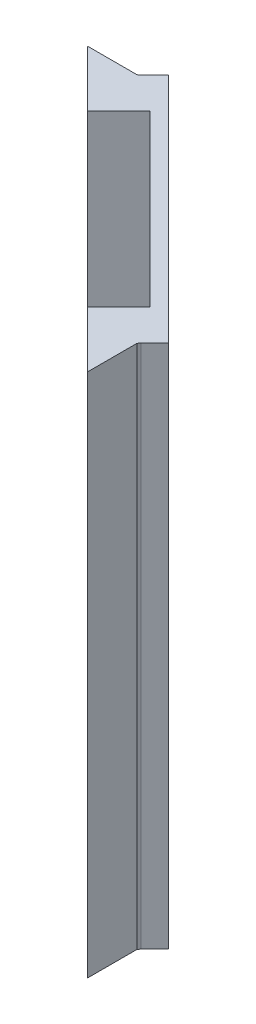
ISO-10303-21;
HEADER;
FILE_DESCRIPTION(('STEP AP214'),'2;1');
FILE_NAME('part.step','',(''),(''),'','','');
FILE_SCHEMA(('AUTOMOTIVE_DESIGN { 1 0 10303 214 1 1 1 1 }'));
ENDSEC;
DATA;
#1=APPLICATION_CONTEXT('core data for automotive mechanical design processes');
#2=APPLICATION_PROTOCOL_DEFINITION('international standard','automotive_design',2000,#1);
#3=PRODUCT_CONTEXT('',#1,'mechanical');
#4=PRODUCT('Part','Part','',(#3));
#5=PRODUCT_RELATED_PRODUCT_CATEGORY('part','',(#4));
#6=PRODUCT_DEFINITION_FORMATION('','',#4);
#7=PRODUCT_DEFINITION_CONTEXT('part definition',#1,'design');
#8=PRODUCT_DEFINITION('design','',#6,#7);
#9=PRODUCT_DEFINITION_SHAPE('','',#8);
#10=(LENGTH_UNIT() NAMED_UNIT(*) SI_UNIT(.MILLI.,.METRE.));
#11=(NAMED_UNIT(*) PLANE_ANGLE_UNIT() SI_UNIT($,.RADIAN.));
#12=(NAMED_UNIT(*) SI_UNIT($,.STERADIAN.) SOLID_ANGLE_UNIT());
#13=UNCERTAINTY_MEASURE_WITH_UNIT(LENGTH_MEASURE(1.E-05),#10,'distance_accuracy_value','');
#14=(GEOMETRIC_REPRESENTATION_CONTEXT(3) GLOBAL_UNCERTAINTY_ASSIGNED_CONTEXT((#13)) GLOBAL_UNIT_ASSIGNED_CONTEXT((#10,
#11,#12)) REPRESENTATION_CONTEXT('',''));
#15=CARTESIAN_POINT('',(0.,0.,0.));
#16=DIRECTION('',(0.,0.,1.));
#17=DIRECTION('',(1.,0.,0.));
#18=AXIS2_PLACEMENT_3D('',#15,#16,#17);
#19=CARTESIAN_POINT('',(45.4413004486133,0.,-45.4413004486145));
#20=DIRECTION('',(0.707106781186538,0.,-0.707106781186557));
#21=DIRECTION('',(-0.707106781186557,0.,-0.707106781186538));
#22=AXIS2_PLACEMENT_3D('',#19,#20,#21);
#23=PLANE('',#22);
#24=DIRECTION('',(0.,-1.,0.));
#25=VECTOR('',#24,1.);
#26=CARTESIAN_POINT('',(80.9542934635455,4.,-9.92830743368317));
#27=LINE('',#26,#25);
#28=CARTESIAN_POINT('',(80.9542934635455,76.,-9.92830743368317));
#29=VERTEX_POINT('',#28);
#30=CARTESIAN_POINT('',(80.9542934635455,4.,-9.92830743368317));
#31=VERTEX_POINT('',#30);
#32=EDGE_CURVE('E220',#29,#31,#27,.T.);
#33=ORIENTED_EDGE('',*,*,#32,.T.);
#34=DIRECTION('',(-0.707106781186557,0.,-0.707106781186538));
#35=VECTOR('',#34,1.);
#36=CARTESIAN_POINT('',(63.2766239338816,4.,-27.6059769633466));
#37=LINE('',#36,#35);
#38=CARTESIAN_POINT('',(63.2766239338816,4.,-27.6059769633466));
#39=VERTEX_POINT('',#38);
#40=EDGE_CURVE('E207',#31,#39,#37,.T.);
#41=ORIENTED_EDGE('',*,*,#40,.T.);
#42=DIRECTION('',(0.,1.,0.));
#43=VECTOR('',#42,1.);
#44=CARTESIAN_POINT('',(63.2766239338816,76.,-27.6059769633466));
#45=LINE('',#44,#43);
#46=CARTESIAN_POINT('',(63.2766239338816,76.,-27.6059769633466));
#47=VERTEX_POINT('',#46);
#48=EDGE_CURVE('E211',#39,#47,#45,.T.);
#49=ORIENTED_EDGE('',*,*,#48,.T.);
#50=DIRECTION('',(0.707106781186556,0.,0.707106781186539));
#51=VECTOR('',#50,1.);
#52=CARTESIAN_POINT('',(80.9542934635455,76.,-9.92830743368317));
#53=LINE('',#52,#51);
#54=EDGE_CURVE('E216',#47,#29,#53,.T.);
#55=ORIENTED_EDGE('',*,*,#54,.T.);
#56=EDGE_LOOP('',(#33,#41,#49,#55));
#57=FACE_BOUND('',#56,.T.);
#58=DIRECTION('',(0.,-1.,0.));
#59=VECTOR('',#58,1.);
#60=CARTESIAN_POINT('',(85.0201574553682,0.,-5.86244344186058));
#61=LINE('',#60,#59);
#62=CARTESIAN_POINT('',(85.0201574553682,80.,-5.86244344186059));
#63=VERTEX_POINT('',#62);
#64=CARTESIAN_POINT('',(85.0201574553682,0.,-5.86244344186058));
#65=VERTEX_POINT('',#64);
#66=EDGE_CURVE('E11',#63,#65,#61,.T.);
#67=ORIENTED_EDGE('',*,*,#66,.F.);
#68=DIRECTION('',(0.707106781186557,0.,0.707106781186538));
#69=VECTOR('',#68,1.);
#70=CARTESIAN_POINT('',(54.4377891690497,80.,-36.4448117281784));
#71=LINE('',#70,#69);
#72=CARTESIAN_POINT('',(59.2107599420589,80.,-31.6718409551692));
#73=VERTEX_POINT('',#72);
#74=EDGE_CURVE('E168',#73,#63,#71,.T.);
#75=ORIENTED_EDGE('',*,*,#74,.F.);
#76=DIRECTION('',(0.,-1.,0.));
#77=VECTOR('',#76,1.);
#78=CARTESIAN_POINT('',(59.2107599420589,80.,-31.6718409551692));
#79=LINE('',#78,#77);
#80=CARTESIAN_POINT('',(59.2107599420589,0.,-31.6718409551692));
#81=VERTEX_POINT('',#80);
#82=EDGE_CURVE('E48',#73,#81,#79,.T.);
#83=ORIENTED_EDGE('',*,*,#82,.T.);
#84=DIRECTION('',(-0.707106781186557,0.,-0.707106781186538));
#85=VECTOR('',#84,1.);
#86=CARTESIAN_POINT('',(89.7931282283775,0.,-1.08947266885144));
#87=LINE('',#86,#85);
#88=EDGE_CURVE('E253',#65,#81,#87,.T.);
#89=ORIENTED_EDGE('',*,*,#88,.F.);
#90=EDGE_LOOP('',(#67,#75,#83,#89));
#91=FACE_BOUND('',#90,.T.);
#92=ADVANCED_FACE('F39',(#57,#91),#23,.F.);
#93=CARTESIAN_POINT('',(54.2610124737531,80.,-26.7220934868633));
#94=DIRECTION('',(-0.707106781186556,0.,-0.707106781186539));
#95=DIRECTION('',(-0.707106781186539,0.,0.707106781186556));
#96=AXIS2_PLACEMENT_3D('',#93,#94,#95);
#97=PLANE('',#96);
#98=ORIENTED_EDGE('',*,*,#82,.F.);
#99=DIRECTION('',(0.707106781186539,0.,-0.707106781186556));
#100=VECTOR('',#99,1.);
#101=CARTESIAN_POINT('',(54.2610124737531,80.,-26.7220934868633));
#102=LINE('',#101,#100);
#103=CARTESIAN_POINT('',(54.4208390212029,80.,-26.8819200343131));
#104=VERTEX_POINT('',#103);
#105=EDGE_CURVE('E313',#104,#73,#102,.T.);
#106=ORIENTED_EDGE('',*,*,#105,.F.);
#107=DIRECTION('',(0.,1.,0.));
#108=VECTOR('',#107,1.);
#109=CARTESIAN_POINT('',(54.4208390212029,80.,-26.8819200343131));
#110=LINE('',#109,#108);
#111=CARTESIAN_POINT('',(54.4208390212029,0.,-26.8819200343131));
#112=VERTEX_POINT('',#111);
#113=EDGE_CURVE('E283',#112,#104,#110,.T.);
#114=ORIENTED_EDGE('',*,*,#113,.F.);
#115=DIRECTION('',(0.707106781186539,0.,-0.707106781186556));
#116=VECTOR('',#115,1.);
#117=CARTESIAN_POINT('',(13.7694594934456,0.,13.7694594934452));
#118=LINE('',#117,#116);
#119=EDGE_CURVE('E268',#112,#81,#118,.T.);
#120=ORIENTED_EDGE('',*,*,#119,.T.);
#121=EDGE_LOOP('',(#98,#106,#114,#120));
#122=FACE_BOUND('',#121,.T.);
#123=ADVANCED_FACE('F362',(#122),#97,.F.);
#124=CARTESIAN_POINT('',(45.806568716614,80.,-35.4877049469927));
#125=DIRECTION('',(0.70675825990358,0.,-0.707455130773722));
#126=DIRECTION('',(-0.707455130773722,0.,-0.70675825990358));
#127=AXIS2_PLACEMENT_3D('',#124,#125,#126);
#128=PLANE('',#127);
#129=DIRECTION('',(0.707455130773722,0.,0.70675825990358));
#130=VECTOR('',#129,1.);
#131=CARTESIAN_POINT('',(45.806568716614,0.,-35.4877049469927));
#132=LINE('',#131,#130);
#133=CARTESIAN_POINT('',(45.806568716614,0.,-35.4877049469927));
#134=VERTEX_POINT('',#133);
#135=EDGE_CURVE('E264',#134,#112,#132,.T.);
#136=ORIENTED_EDGE('',*,*,#135,.T.);
#137=ORIENTED_EDGE('',*,*,#113,.T.);
#138=DIRECTION('',(0.707455130773722,0.,0.70675825990358));
#139=VECTOR('',#138,1.);
#140=CARTESIAN_POINT('',(45.806568716614,80.,-35.4877049469927));
#141=LINE('',#140,#139);
#142=CARTESIAN_POINT('',(45.806568716614,80.,-35.4877049469927));
#143=VERTEX_POINT('',#142);
#144=EDGE_CURVE('E316',#143,#104,#141,.T.);
#145=ORIENTED_EDGE('',*,*,#144,.F.);
#146=DIRECTION('',(0.,-1.,0.));
#147=VECTOR('',#146,1.);
#148=CARTESIAN_POINT('',(45.806568716614,80.,-35.4877049469927));
#149=LINE('',#148,#147);
#150=EDGE_CURVE('E278',#143,#134,#149,.T.);
#151=ORIENTED_EDGE('',*,*,#150,.T.);
#152=EDGE_LOOP('',(#136,#137,#145,#151));
#153=FACE_BOUND('',#152,.T.);
#154=ADVANCED_FACE('F41',(#153),#128,.F.);
#155=CARTESIAN_POINT('',(91.2073417907506,80.,-2.50368623122455));
#156=DIRECTION('',(-0.707106781186539,0.,0.707106781186556));
#157=DIRECTION('',(0.707106781186556,0.,0.707106781186539));
#158=AXIS2_PLACEMENT_3D('',#155,#156,#157);
#159=PLANE('',#158);
#160=DIRECTION('',(-0.707106781186556,0.,-0.707106781186538));
#161=VECTOR('',#160,1.);
#162=CARTESIAN_POINT('',(91.2073417907506,0.,-2.50368623122455));
#163=LINE('',#162,#161);
#164=CARTESIAN_POINT('',(91.2073417907506,0.,-2.50368623122455));
#165=VERTEX_POINT('',#164);
#166=CARTESIAN_POINT('',(55.8520027314227,0.,-37.8590252905515));
#167=VERTEX_POINT('',#166);
#168=EDGE_CURVE('E282',#165,#167,#163,.T.);
#169=ORIENTED_EDGE('',*,*,#168,.T.);
#170=DIRECTION('',(0.,-1.,0.));
#171=VECTOR('',#170,1.);
#172=CARTESIAN_POINT('',(55.8520027314227,80.,-37.8590252905515));
#173=LINE('',#172,#171);
#174=CARTESIAN_POINT('',(55.8520027314227,80.,-37.8590252905515));
#175=VERTEX_POINT('',#174);
#176=EDGE_CURVE('E271',#175,#167,#173,.T.);
#177=ORIENTED_EDGE('',*,*,#176,.F.);
#178=DIRECTION('',(-0.707106781186556,0.,-0.707106781186538));
#179=VECTOR('',#178,1.);
#180=CARTESIAN_POINT('',(91.2073417907506,80.,-2.50368623122455));
#181=LINE('',#180,#179);
#182=CARTESIAN_POINT('',(91.2073417907506,80.,-2.50368623122455));
#183=VERTEX_POINT('',#182);
#184=EDGE_CURVE('E304',#183,#175,#181,.T.);
#185=ORIENTED_EDGE('',*,*,#184,.F.);
#186=DIRECTION('',(0.,-1.,0.));
#187=VECTOR('',#186,1.);
#188=CARTESIAN_POINT('',(91.2073417907506,80.,-2.50368623122455));
#189=LINE('',#188,#187);
#190=EDGE_CURVE('E241',#183,#165,#189,.T.);
#191=ORIENTED_EDGE('',*,*,#190,.T.);
#192=EDGE_LOOP('',(#169,#177,#185,#191));
#193=FACE_BOUND('',#192,.T.);
#194=DIRECTION('',(-0.707106781186557,0.,-0.707106781186538));
#195=VECTOR('',#194,1.);
#196=CARTESIAN_POINT('',(64.6908374962547,4.,-29.0201905257198));
#197=LINE('',#196,#195);
#198=CARTESIAN_POINT('',(82.3685070259186,4.,-11.3425209960563));
#199=VERTEX_POINT('',#198);
#200=CARTESIAN_POINT('',(64.6908374962547,4.,-29.0201905257198));
#201=VERTEX_POINT('',#200);
#202=EDGE_CURVE('E206',#199,#201,#197,.T.);
#203=ORIENTED_EDGE('',*,*,#202,.F.);
#204=DIRECTION('',(0.,-1.,0.));
#205=VECTOR('',#204,1.);
#206=CARTESIAN_POINT('',(82.3685070259186,4.,-11.3425209960563));
#207=LINE('',#206,#205);
#208=CARTESIAN_POINT('',(82.3685070259186,76.,-11.3425209960563));
#209=VERTEX_POINT('',#208);
#210=EDGE_CURVE('E212',#209,#199,#207,.T.);
#211=ORIENTED_EDGE('',*,*,#210,.F.);
#212=DIRECTION('',(0.707106781186556,0.,0.707106781186539));
#213=VECTOR('',#212,1.);
#214=CARTESIAN_POINT('',(82.3685070259186,76.,-11.3425209960563));
#215=LINE('',#214,#213);
#216=CARTESIAN_POINT('',(64.6908374962547,76.,-29.0201905257197));
#217=VERTEX_POINT('',#216);
#218=EDGE_CURVE('E231',#217,#209,#215,.T.);
#219=ORIENTED_EDGE('',*,*,#218,.F.);
#220=DIRECTION('',(0.,1.,0.));
#221=VECTOR('',#220,1.);
#222=CARTESIAN_POINT('',(64.6908374962547,76.,-29.0201905257197));
#223=LINE('',#222,#221);
#224=EDGE_CURVE('E227',#201,#217,#223,.T.);
#225=ORIENTED_EDGE('',*,*,#224,.F.);
#226=EDGE_LOOP('',(#203,#211,#219,#225));
#227=FACE_BOUND('',#226,.T.);
#228=ADVANCED_FACE('F343',(#193,#227),#159,.F.);
#229=CARTESIAN_POINT('',(0.,80.,0.));
#230=DIRECTION('',(0.,-1.,0.));
#231=DIRECTION('',(0.,0.,-1.));
#232=AXIS2_PLACEMENT_3D('',#229,#230,#231);
#233=PLANE('',#232);
#234=ORIENTED_EDGE('',*,*,#184,.T.);
#235=DIRECTION('',(-0.707106781186539,0.,0.707106781186556));
#236=VECTOR('',#235,1.);
#237=CARTESIAN_POINT('',(55.8520027314227,80.,-37.8590252905515));
#238=LINE('',#237,#236);
#239=CARTESIAN_POINT('',(53.7306823878631,80.,-35.7377049469918));
#240=VERTEX_POINT('',#239);
#241=EDGE_CURVE('E300',#175,#240,#238,.T.);
#242=ORIENTED_EDGE('',*,*,#241,.T.);
#243=DIRECTION('',(-0.816496580928664,0.,0.5773502691883));
#244=VECTOR('',#243,1.);
#245=CARTESIAN_POINT('',(53.7306823878631,80.,-35.7377049469918));
#246=LINE('',#245,#244);
#247=CARTESIAN_POINT('',(53.3771289972699,80.,-35.4877049469927));
#248=VERTEX_POINT('',#247);
#249=EDGE_CURVE('E303',#240,#248,#246,.T.);
#250=ORIENTED_EDGE('',*,*,#249,.T.);
#251=DIRECTION('',(-1.,0.,0.));
#252=VECTOR('',#251,1.);
#253=CARTESIAN_POINT('',(53.3771289972699,80.,-35.4877049469927));
#254=LINE('',#253,#252);
#255=EDGE_CURVE('E299',#248,#143,#254,.T.);
#256=ORIENTED_EDGE('',*,*,#255,.T.);
#257=ORIENTED_EDGE('',*,*,#144,.T.);
#258=ORIENTED_EDGE('',*,*,#105,.T.);
#259=ORIENTED_EDGE('',*,*,#74,.T.);
#260=DIRECTION('',(0.707106781186539,0.,-0.707106781186556));
#261=VECTOR('',#260,1.);
#262=CARTESIAN_POINT('',(80.0704099870625,80.,-0.912695973554688));
#263=LINE('',#262,#261);
#264=CARTESIAN_POINT('',(80.242954429436,80.,-1.0852404159282));
#265=VERTEX_POINT('',#264);
#266=EDGE_CURVE('E155',#265,#63,#263,.T.);
#267=ORIENTED_EDGE('',*,*,#266,.F.);
#268=DIRECTION('',(0.707455130773722,0.,0.70675825990358));
#269=VECTOR('',#268,1.);
#270=CARTESIAN_POINT('',(45.806568716614,80.,-35.4877049469927));
#271=LINE('',#270,#269);
#272=CARTESIAN_POINT('',(88.8360214471905,80.,7.49936209598085));
#273=VERTEX_POINT('',#272);
#274=EDGE_CURVE('E166',#265,#273,#271,.T.);
#275=ORIENTED_EDGE('',*,*,#274,.T.);
#276=DIRECTION('',(0.,0.,-1.));
#277=VECTOR('',#276,1.);
#278=CARTESIAN_POINT('',(88.8360214471905,80.,7.49936209598085));
#279=LINE('',#278,#277);
#280=CARTESIAN_POINT('',(88.8360214471905,80.,-0.0288124970711651));
#281=VERTEX_POINT('',#280);
#282=EDGE_CURVE('E176',#273,#281,#279,.T.);
#283=ORIENTED_EDGE('',*,*,#282,.T.);
#284=DIRECTION('',(0.577350269189804,0.,-0.8164965809276));
#285=VECTOR('',#284,1.);
#286=CARTESIAN_POINT('',(88.8360214471905,80.,-0.0288124970711651));
#287=LINE('',#286,#285);
#288=CARTESIAN_POINT('',(89.0860214471909,80.,-0.382365887664884));
#289=VERTEX_POINT('',#288);
#290=EDGE_CURVE('E181',#281,#289,#287,.T.);
#291=ORIENTED_EDGE('',*,*,#290,.T.);
#292=DIRECTION('',(0.707106781186539,0.,-0.707106781186557));
#293=VECTOR('',#292,1.);
#294=CARTESIAN_POINT('',(89.7931282283775,80.,-1.08947266885144));
#295=LINE('',#294,#293);
#296=EDGE_CURVE('E256',#289,#183,#295,.T.);
#297=ORIENTED_EDGE('',*,*,#296,.T.);
#298=EDGE_LOOP('',(#234,#242,#250,#256,#257,#258,#259,#267,#275,#283,#291,#297));
#299=FACE_BOUND('',#298,.T.);
#300=ADVANCED_FACE('F165',(#299),#233,.F.);
#301=CARTESIAN_POINT('',(0.,0.,0.));
#302=DIRECTION('',(0.,-1.,0.));
#303=DIRECTION('',(0.,0.,-1.));
#304=AXIS2_PLACEMENT_3D('',#301,#302,#303);
#305=PLANE('',#304);
#306=DIRECTION('',(-0.707106781186539,0.,0.707106781186556));
#307=VECTOR('',#306,1.);
#308=CARTESIAN_POINT('',(39.5788570067549,0.,39.5788570067539));
#309=LINE('',#308,#307);
#310=CARTESIAN_POINT('',(80.242954429436,0.,-1.0852404159282));
#311=VERTEX_POINT('',#310);
#312=EDGE_CURVE('E157',#65,#311,#309,.T.);
#313=ORIENTED_EDGE('',*,*,#312,.F.);
#314=ORIENTED_EDGE('',*,*,#88,.T.);
#315=ORIENTED_EDGE('',*,*,#119,.F.);
#316=ORIENTED_EDGE('',*,*,#135,.F.);
#317=DIRECTION('',(-1.,0.,0.));
#318=VECTOR('',#317,1.);
#319=CARTESIAN_POINT('',(53.3771289972699,0.,-35.4877049469927));
#320=LINE('',#319,#318);
#321=CARTESIAN_POINT('',(53.3771289972699,0.,-35.4877049469927));
#322=VERTEX_POINT('',#321);
#323=EDGE_CURVE('E277',#322,#134,#320,.T.);
#324=ORIENTED_EDGE('',*,*,#323,.F.);
#325=DIRECTION('',(-0.816496580928664,0.,0.5773502691883));
#326=VECTOR('',#325,1.);
#327=CARTESIAN_POINT('',(53.7306823878631,0.,-35.7377049469918));
#328=LINE('',#327,#326);
#329=CARTESIAN_POINT('',(53.7306823878631,0.,-35.7377049469918));
#330=VERTEX_POINT('',#329);
#331=EDGE_CURVE('E291',#330,#322,#328,.T.);
#332=ORIENTED_EDGE('',*,*,#331,.F.);
#333=DIRECTION('',(-0.707106781186539,0.,0.707106781186556));
#334=VECTOR('',#333,1.);
#335=CARTESIAN_POINT('',(55.8520027314227,0.,-37.8590252905515));
#336=LINE('',#335,#334);
#337=EDGE_CURVE('E276',#167,#330,#336,.T.);
#338=ORIENTED_EDGE('',*,*,#337,.F.);
#339=ORIENTED_EDGE('',*,*,#168,.F.);
#340=DIRECTION('',(0.707106781186539,0.,-0.707106781186557));
#341=VECTOR('',#340,1.);
#342=CARTESIAN_POINT('',(89.7931282283775,0.,-1.08947266885144));
#343=LINE('',#342,#341);
#344=CARTESIAN_POINT('',(89.0860214471909,0.,-0.382365887664884));
#345=VERTEX_POINT('',#344);
#346=EDGE_CURVE('E260',#345,#165,#343,.T.);
#347=ORIENTED_EDGE('',*,*,#346,.F.);
#348=DIRECTION('',(0.577350269189804,0.,-0.8164965809276));
#349=VECTOR('',#348,1.);
#350=CARTESIAN_POINT('',(88.8360214471905,0.,-0.0288124970711651));
#351=LINE('',#350,#349);
#352=CARTESIAN_POINT('',(88.8360214471905,0.,-0.0288124970711651));
#353=VERTEX_POINT('',#352);
#354=EDGE_CURVE('E177',#353,#345,#351,.T.);
#355=ORIENTED_EDGE('',*,*,#354,.F.);
#356=DIRECTION('',(0.,0.,-1.));
#357=VECTOR('',#356,1.);
#358=CARTESIAN_POINT('',(88.8360214471905,0.,7.49936209598085));
#359=LINE('',#358,#357);
#360=CARTESIAN_POINT('',(88.8360214471905,0.,7.49936209598085));
#361=VERTEX_POINT('',#360);
#362=EDGE_CURVE('E184',#361,#353,#359,.T.);
#363=ORIENTED_EDGE('',*,*,#362,.F.);
#364=DIRECTION('',(0.707455130773722,0.,0.70675825990358));
#365=VECTOR('',#364,1.);
#366=CARTESIAN_POINT('',(45.806568716614,0.,-35.4877049469927));
#367=LINE('',#366,#365);
#368=EDGE_CURVE('E162',#311,#361,#367,.T.);
#369=ORIENTED_EDGE('',*,*,#368,.F.);
#370=EDGE_LOOP('',(#313,#314,#315,#316,#324,#332,#338,#339,#347,#355,#363,#369));
#371=FACE_BOUND('',#370,.T.);
#372=ADVANCED_FACE('F329',(#371),#305,.T.);
#373=CARTESIAN_POINT('',(53.7306823878631,80.,-35.7377049469918));
#374=DIRECTION('',(0.5773502691883,0.,0.816496580928664));
#375=DIRECTION('',(0.816496580928664,0.,-0.5773502691883));
#376=AXIS2_PLACEMENT_3D('',#373,#374,#375);
#377=PLANE('',#376);
#378=ORIENTED_EDGE('',*,*,#331,.T.);
#379=DIRECTION('',(0.,-1.,0.));
#380=VECTOR('',#379,1.);
#381=CARTESIAN_POINT('',(53.3771289972699,80.,-35.4877049469927));
#382=LINE('',#381,#380);
#383=EDGE_CURVE('E272',#248,#322,#382,.T.);
#384=ORIENTED_EDGE('',*,*,#383,.F.);
#385=ORIENTED_EDGE('',*,*,#249,.F.);
#386=DIRECTION('',(0.,-1.,0.));
#387=VECTOR('',#386,1.);
#388=CARTESIAN_POINT('',(53.7306823878631,80.,-35.7377049469918));
#389=LINE('',#388,#387);
#390=EDGE_CURVE('E287',#240,#330,#389,.T.);
#391=ORIENTED_EDGE('',*,*,#390,.T.);
#392=EDGE_LOOP('',(#378,#384,#385,#391));
#393=FACE_BOUND('',#392,.T.);
#394=ADVANCED_FACE('F355',(#393),#377,.F.);
#395=CARTESIAN_POINT('',(53.3771289972699,80.,-35.4877049469927));
#396=DIRECTION('',(0.,0.,1.));
#397=DIRECTION('',(1.,0.,0.));
#398=AXIS2_PLACEMENT_3D('',#395,#396,#397);
#399=PLANE('',#398);
#400=ORIENTED_EDGE('',*,*,#323,.T.);
#401=ORIENTED_EDGE('',*,*,#150,.F.);
#402=ORIENTED_EDGE('',*,*,#255,.F.);
#403=ORIENTED_EDGE('',*,*,#383,.T.);
#404=EDGE_LOOP('',(#400,#401,#402,#403));
#405=FACE_BOUND('',#404,.T.);
#406=ADVANCED_FACE('F357',(#405),#399,.F.);
#407=CARTESIAN_POINT('',(55.8520027314227,80.,-37.8590252905515));
#408=DIRECTION('',(0.707106781186556,0.,0.707106781186539));
#409=DIRECTION('',(0.707106781186539,0.,-0.707106781186556));
#410=AXIS2_PLACEMENT_3D('',#407,#408,#409);
#411=PLANE('',#410);
#412=ORIENTED_EDGE('',*,*,#337,.T.);
#413=ORIENTED_EDGE('',*,*,#390,.F.);
#414=ORIENTED_EDGE('',*,*,#241,.F.);
#415=ORIENTED_EDGE('',*,*,#176,.T.);
#416=EDGE_LOOP('',(#412,#413,#414,#415));
#417=FACE_BOUND('',#416,.T.);
#418=ADVANCED_FACE('F351',(#417),#411,.F.);
#419=CARTESIAN_POINT('',(89.7931282283775,80.,-1.08947266885144));
#420=DIRECTION('',(0.707106781186557,0.,0.707106781186539));
#421=DIRECTION('',(0.707106781186539,0.,-0.707106781186557));
#422=AXIS2_PLACEMENT_3D('',#419,#420,#421);
#423=PLANE('',#422);
#424=ORIENTED_EDGE('',*,*,#190,.F.);
#425=ORIENTED_EDGE('',*,*,#296,.F.);
#426=DIRECTION('',(0.,-1.,0.));
#427=VECTOR('',#426,1.);
#428=CARTESIAN_POINT('',(89.0860214471909,80.,-0.382365887664884));
#429=LINE('',#428,#427);
#430=EDGE_CURVE('E190',#289,#345,#429,.T.);
#431=ORIENTED_EDGE('',*,*,#430,.T.);
#432=ORIENTED_EDGE('',*,*,#346,.T.);
#433=EDGE_LOOP('',(#424,#425,#431,#432));
#434=FACE_BOUND('',#433,.T.);
#435=ADVANCED_FACE('F341',(#434),#423,.T.);
#436=CARTESIAN_POINT('',(63.2766239338816,4.,-27.6059769633466));
#437=DIRECTION('',(0.,-1.,0.));
#438=DIRECTION('',(1.,0.,0.));
#439=AXIS2_PLACEMENT_3D('',#436,#437,#438);
#440=PLANE('',#439);
#441=ORIENTED_EDGE('',*,*,#202,.T.);
#442=DIRECTION('',(0.707106781186539,0.,-0.707106781186557));
#443=VECTOR('',#442,1.);
#444=CARTESIAN_POINT('',(63.2766239338816,4.,-27.6059769633466));
#445=LINE('',#444,#443);
#446=EDGE_CURVE('E224',#39,#201,#445,.T.);
#447=ORIENTED_EDGE('',*,*,#446,.F.);
#448=ORIENTED_EDGE('',*,*,#40,.F.);
#449=DIRECTION('',(0.707106781186539,0.,-0.707106781186557));
#450=VECTOR('',#449,1.);
#451=CARTESIAN_POINT('',(80.9542934635455,4.,-9.92830743368317));
#452=LINE('',#451,#450);
#453=EDGE_CURVE('E238',#31,#199,#452,.T.);
#454=ORIENTED_EDGE('',*,*,#453,.T.);
#455=EDGE_LOOP('',(#441,#447,#448,#454));
#456=FACE_BOUND('',#455,.T.);
#457=ADVANCED_FACE('F413',(#456),#440,.F.);
#458=CARTESIAN_POINT('',(80.9542934635455,4.,-9.92830743368317));
#459=DIRECTION('',(0.707106781186557,0.,0.707106781186539));
#460=DIRECTION('',(0.707106781186539,0.,-0.707106781186557));
#461=AXIS2_PLACEMENT_3D('',#458,#459,#460);
#462=PLANE('',#461);
#463=ORIENTED_EDGE('',*,*,#210,.T.);
#464=ORIENTED_EDGE('',*,*,#453,.F.);
#465=ORIENTED_EDGE('',*,*,#32,.F.);
#466=DIRECTION('',(0.707106781186539,0.,-0.707106781186557));
#467=VECTOR('',#466,1.);
#468=CARTESIAN_POINT('',(80.9542934635455,76.,-9.92830743368317));
#469=LINE('',#468,#467);
#470=EDGE_CURVE('E242',#29,#209,#469,.T.);
#471=ORIENTED_EDGE('',*,*,#470,.T.);
#472=EDGE_LOOP('',(#463,#464,#465,#471));
#473=FACE_BOUND('',#472,.T.);
#474=ADVANCED_FACE('F420',(#473),#462,.F.);
#475=CARTESIAN_POINT('',(80.9542934635455,76.,-9.92830743368317));
#476=DIRECTION('',(0.,1.,0.));
#477=DIRECTION('',(-1.,0.,0.));
#478=AXIS2_PLACEMENT_3D('',#475,#476,#477);
#479=PLANE('',#478);
#480=ORIENTED_EDGE('',*,*,#218,.T.);
#481=ORIENTED_EDGE('',*,*,#470,.F.);
#482=ORIENTED_EDGE('',*,*,#54,.F.);
#483=DIRECTION('',(0.707106781186539,0.,-0.707106781186557));
#484=VECTOR('',#483,1.);
#485=CARTESIAN_POINT('',(63.2766239338816,76.,-27.6059769633466));
#486=LINE('',#485,#484);
#487=EDGE_CURVE('E245',#47,#217,#486,.T.);
#488=ORIENTED_EDGE('',*,*,#487,.T.);
#489=EDGE_LOOP('',(#480,#481,#482,#488));
#490=FACE_BOUND('',#489,.T.);
#491=ADVANCED_FACE('F428',(#490),#479,.F.);
#492=CARTESIAN_POINT('',(63.2766239338816,76.,-27.6059769633466));
#493=DIRECTION('',(-0.707106781186557,0.,-0.707106781186539));
#494=DIRECTION('',(-0.707106781186539,0.,0.707106781186557));
#495=AXIS2_PLACEMENT_3D('',#492,#493,#494);
#496=PLANE('',#495);
#497=ORIENTED_EDGE('',*,*,#224,.T.);
#498=ORIENTED_EDGE('',*,*,#487,.F.);
#499=ORIENTED_EDGE('',*,*,#48,.F.);
#500=ORIENTED_EDGE('',*,*,#446,.T.);
#501=EDGE_LOOP('',(#497,#498,#499,#500));
#502=FACE_BOUND('',#501,.T.);
#503=ADVANCED_FACE('F436',(#502),#496,.F.);
#504=CARTESIAN_POINT('',(80.0704099870625,0.,-0.912695973554688));
#505=DIRECTION('',(0.707106781186556,0.,0.707106781186539));
#506=DIRECTION('',(0.707106781186539,0.,-0.707106781186556));
#507=AXIS2_PLACEMENT_3D('',#504,#505,#506);
#508=PLANE('',#507);
#509=ORIENTED_EDGE('',*,*,#266,.T.);
#510=ORIENTED_EDGE('',*,*,#66,.T.);
#511=ORIENTED_EDGE('',*,*,#312,.T.);
#512=DIRECTION('',(0.,-1.,0.));
#513=VECTOR('',#512,1.);
#514=CARTESIAN_POINT('',(80.242954429436,80.,-1.08524041592821));
#515=LINE('',#514,#513);
#516=EDGE_CURVE('E152',#265,#311,#515,.T.);
#517=ORIENTED_EDGE('',*,*,#516,.F.);
#518=EDGE_LOOP('',(#509,#510,#511,#517));
#519=FACE_BOUND('',#518,.T.);
#520=ADVANCED_FACE('F154',(#519),#508,.F.);
#521=CARTESIAN_POINT('',(88.8360214471905,80.,7.49936209598085));
#522=DIRECTION('',(-1.,0.,0.));
#523=DIRECTION('',(0.,0.,1.));
#524=AXIS2_PLACEMENT_3D('',#521,#522,#523);
#525=PLANE('',#524);
#526=ORIENTED_EDGE('',*,*,#362,.T.);
#527=DIRECTION('',(0.,-1.,0.));
#528=VECTOR('',#527,1.);
#529=CARTESIAN_POINT('',(88.8360214471905,80.,-0.0288124970711651));
#530=LINE('',#529,#528);
#531=EDGE_CURVE('E198',#281,#353,#530,.T.);
#532=ORIENTED_EDGE('',*,*,#531,.F.);
#533=ORIENTED_EDGE('',*,*,#282,.F.);
#534=DIRECTION('',(0.,-1.,0.));
#535=VECTOR('',#534,1.);
#536=CARTESIAN_POINT('',(88.8360214471905,80.,7.49936209598085));
#537=LINE('',#536,#535);
#538=EDGE_CURVE('E173',#273,#361,#537,.T.);
#539=ORIENTED_EDGE('',*,*,#538,.T.);
#540=EDGE_LOOP('',(#526,#532,#533,#539));
#541=FACE_BOUND('',#540,.T.);
#542=ADVANCED_FACE('F333',(#541),#525,.F.);
#543=CARTESIAN_POINT('',(88.8360214471905,80.,-0.0288124970711651));
#544=DIRECTION('',(-0.8164965809276,0.,-0.577350269189804));
#545=DIRECTION('',(-0.577350269189804,0.,0.8164965809276));
#546=AXIS2_PLACEMENT_3D('',#543,#544,#545);
#547=PLANE('',#546);
#548=ORIENTED_EDGE('',*,*,#354,.T.);
#549=ORIENTED_EDGE('',*,*,#430,.F.);
#550=ORIENTED_EDGE('',*,*,#290,.F.);
#551=ORIENTED_EDGE('',*,*,#531,.T.);
#552=EDGE_LOOP('',(#548,#549,#550,#551));
#553=FACE_BOUND('',#552,.T.);
#554=ADVANCED_FACE('F339',(#553),#547,.F.);
#555=CARTESIAN_POINT('',(45.806568716614,80.,-35.4877049469927));
#556=DIRECTION('',(0.70675825990358,0.,-0.707455130773722));
#557=DIRECTION('',(-0.707455130773722,0.,-0.70675825990358));
#558=AXIS2_PLACEMENT_3D('',#555,#556,#557);
#559=PLANE('',#558);
#560=ORIENTED_EDGE('',*,*,#274,.F.);
#561=ORIENTED_EDGE('',*,*,#516,.T.);
#562=ORIENTED_EDGE('',*,*,#368,.T.);
#563=ORIENTED_EDGE('',*,*,#538,.F.);
#564=EDGE_LOOP('',(#560,#561,#562,#563));
#565=FACE_BOUND('',#564,.T.);
#566=ADVANCED_FACE('F171',(#565),#559,.F.);
#567=CLOSED_SHELL('',(#92,#123,#154,#228,#300,#372,#394,#406,#418,#435,#457,#474,#491,#503,#520,
#542,#554,#566));
#568=MANIFOLD_SOLID_BREP('B2',#567);
#569=ADVANCED_BREP_SHAPE_REPRESENTATION('',(#18,#568),#14);
#570=SHAPE_DEFINITION_REPRESENTATION(#9,#569);
ENDSEC;
END-ISO-10303-21;
